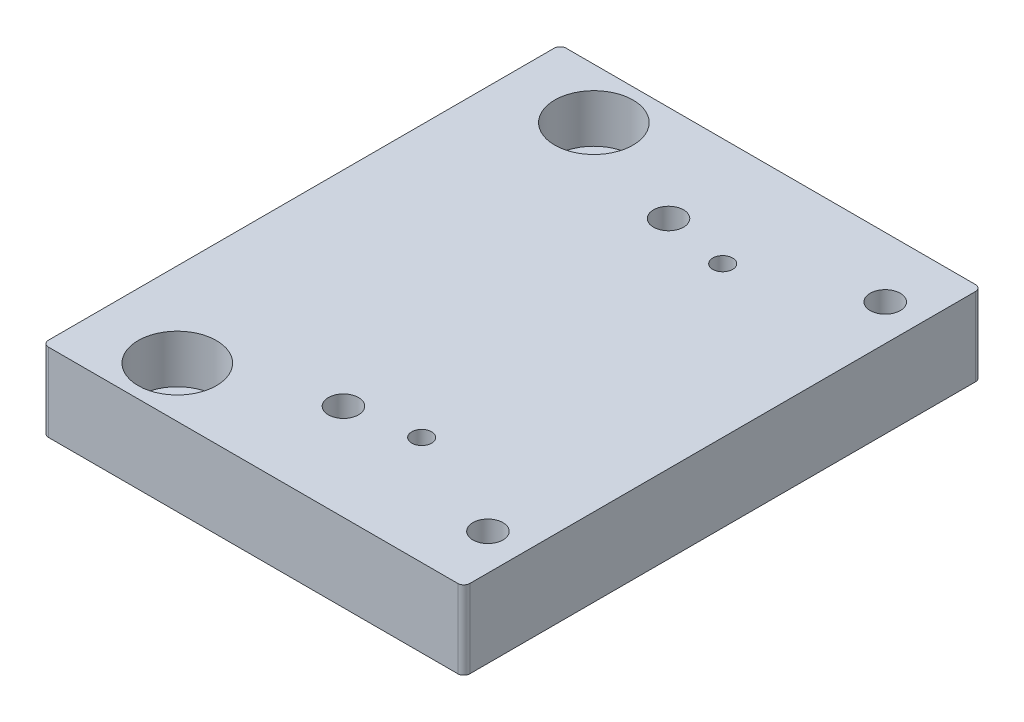
ISO-10303-21;
HEADER;
FILE_DESCRIPTION(('STEP AP214'),'2;1');
FILE_NAME('part.step','',(''),(''),'','','');
FILE_SCHEMA(('AUTOMOTIVE_DESIGN { 1 0 10303 214 1 1 1 1 }'));
ENDSEC;
DATA;
#1=APPLICATION_CONTEXT('core data for automotive mechanical design processes');
#2=APPLICATION_PROTOCOL_DEFINITION('international standard','automotive_design',2000,#1);
#3=PRODUCT_CONTEXT('',#1,'mechanical');
#4=PRODUCT('Part','Part','',(#3));
#5=PRODUCT_RELATED_PRODUCT_CATEGORY('part','',(#4));
#6=PRODUCT_DEFINITION_FORMATION('','',#4);
#7=PRODUCT_DEFINITION_CONTEXT('part definition',#1,'design');
#8=PRODUCT_DEFINITION('design','',#6,#7);
#9=PRODUCT_DEFINITION_SHAPE('','',#8);
#10=(LENGTH_UNIT() NAMED_UNIT(*) SI_UNIT(.MILLI.,.METRE.));
#11=(NAMED_UNIT(*) PLANE_ANGLE_UNIT() SI_UNIT($,.RADIAN.));
#12=(NAMED_UNIT(*) SI_UNIT($,.STERADIAN.) SOLID_ANGLE_UNIT());
#13=UNCERTAINTY_MEASURE_WITH_UNIT(LENGTH_MEASURE(1.E-05),#10,'distance_accuracy_value','');
#14=(GEOMETRIC_REPRESENTATION_CONTEXT(3) GLOBAL_UNCERTAINTY_ASSIGNED_CONTEXT((#13)) GLOBAL_UNIT_ASSIGNED_CONTEXT((#10,
#11,#12)) REPRESENTATION_CONTEXT('',''));
#15=CARTESIAN_POINT('',(0.,0.,0.));
#16=DIRECTION('',(0.,0.,1.));
#17=DIRECTION('',(1.,0.,0.));
#18=AXIS2_PLACEMENT_3D('',#15,#16,#17);
#19=CARTESIAN_POINT('',(14.,-8.,77.6));
#20=DIRECTION('',(0.,1.,0.));
#21=DIRECTION('',(0.,0.,1.));
#22=AXIS2_PLACEMENT_3D('',#19,#20,#21);
#23=CYLINDRICAL_SURFACE('',#22,2.99999999999999);
#24=CARTESIAN_POINT('',(14.,-8.,77.6));
#25=DIRECTION('',(0.,1.,0.));
#26=DIRECTION('',(0.,0.,-1.));
#27=AXIS2_PLACEMENT_3D('',#24,#25,#26);
#28=CIRCLE('',#27,2.99999999999999);
#29=CARTESIAN_POINT('',(14.,-8.,74.6));
#30=VERTEX_POINT('',#29);
#31=EDGE_CURVE('E129',#30,#30,#28,.T.);
#32=ORIENTED_EDGE('',*,*,#31,.F.);
#33=EDGE_LOOP('',(#32));
#34=FACE_BOUND('',#33,.T.);
#35=CARTESIAN_POINT('',(14.,-3.,77.6));
#36=DIRECTION('',(0.,1.,0.));
#37=DIRECTION('',(0.,0.,1.));
#38=AXIS2_PLACEMENT_3D('',#35,#36,#37);
#39=CIRCLE('',#38,2.99999999999999);
#40=CARTESIAN_POINT('',(14.,-3.,80.6));
#41=VERTEX_POINT('',#40);
#42=EDGE_CURVE('E37',#41,#41,#39,.F.);
#43=ORIENTED_EDGE('',*,*,#42,.F.);
#44=EDGE_LOOP('',(#43));
#45=FACE_BOUND('',#44,.T.);
#46=ADVANCED_FACE('F33',(#34,#45),#23,.F.);
#47=CARTESIAN_POINT('',(14.,-8.,8.4));
#48=DIRECTION('',(0.,1.,0.));
#49=DIRECTION('',(0.,0.,1.));
#50=AXIS2_PLACEMENT_3D('',#47,#48,#49);
#51=CYLINDRICAL_SURFACE('',#50,3.);
#52=CARTESIAN_POINT('',(14.,-8.,8.4));
#53=DIRECTION('',(0.,1.,0.));
#54=DIRECTION('',(0.,0.,1.));
#55=AXIS2_PLACEMENT_3D('',#52,#53,#54);
#56=CIRCLE('',#55,3.);
#57=CARTESIAN_POINT('',(14.,-8.,11.4));
#58=VERTEX_POINT('',#57);
#59=EDGE_CURVE('E126',#58,#58,#56,.T.);
#60=ORIENTED_EDGE('',*,*,#59,.F.);
#61=EDGE_LOOP('',(#60));
#62=FACE_BOUND('',#61,.T.);
#63=CARTESIAN_POINT('',(14.,-3.,8.4));
#64=DIRECTION('',(0.,1.,0.));
#65=DIRECTION('',(0.,0.,1.));
#66=AXIS2_PLACEMENT_3D('',#63,#64,#65);
#67=CIRCLE('',#66,3.);
#68=CARTESIAN_POINT('',(14.,-3.,11.4));
#69=VERTEX_POINT('',#68);
#70=EDGE_CURVE('E169',#69,#69,#67,.F.);
#71=ORIENTED_EDGE('',*,*,#70,.F.);
#72=EDGE_LOOP('',(#71));
#73=FACE_BOUND('',#72,.T.);
#74=ADVANCED_FACE('F227',(#62,#73),#51,.F.);
#75=CARTESIAN_POINT('',(0.,5.,0.));
#76=DIRECTION('',(1.,0.,0.));
#77=DIRECTION('',(0.,0.,-1.));
#78=AXIS2_PLACEMENT_3D('',#75,#76,#77);
#79=PLANE('',#78);
#80=DIRECTION('',(0.,0.,1.));
#81=VECTOR('',#80,1.);
#82=CARTESIAN_POINT('',(0.,5.,0.));
#83=LINE('',#82,#81);
#84=CARTESIAN_POINT('',(0.,5.,1.));
#85=VERTEX_POINT('',#84);
#86=CARTESIAN_POINT('',(0.,5.,85.));
#87=VERTEX_POINT('',#86);
#88=EDGE_CURVE('E148',#85,#87,#83,.T.);
#89=ORIENTED_EDGE('',*,*,#88,.F.);
#90=DIRECTION('',(0.,-1.,0.));
#91=VECTOR('',#90,1.);
#92=CARTESIAN_POINT('',(0.,5.,1.));
#93=LINE('',#92,#91);
#94=CARTESIAN_POINT('',(0.,-8.,1.));
#95=VERTEX_POINT('',#94);
#96=EDGE_CURVE('E11',#85,#95,#93,.T.);
#97=ORIENTED_EDGE('',*,*,#96,.T.);
#98=DIRECTION('',(0.,0.,-1.));
#99=VECTOR('',#98,1.);
#100=CARTESIAN_POINT('',(0.,-8.,85.));
#101=LINE('',#100,#99);
#102=CARTESIAN_POINT('',(0.,-8.,85.));
#103=VERTEX_POINT('',#102);
#104=EDGE_CURVE('E140',#103,#95,#101,.T.);
#105=ORIENTED_EDGE('',*,*,#104,.F.);
#106=DIRECTION('',(0.,-1.,0.));
#107=VECTOR('',#106,1.);
#108=CARTESIAN_POINT('',(0.,5.,85.));
#109=LINE('',#108,#107);
#110=EDGE_CURVE('E42',#103,#87,#109,.F.);
#111=ORIENTED_EDGE('',*,*,#110,.T.);
#112=EDGE_LOOP('',(#89,#97,#105,#111));
#113=FACE_BOUND('',#112,.T.);
#114=ADVANCED_FACE('F271',(#113),#79,.F.);
#115=CARTESIAN_POINT('',(0.,5.,86.));
#116=DIRECTION('',(0.,0.,-1.));
#117=DIRECTION('',(-1.,0.,0.));
#118=AXIS2_PLACEMENT_3D('',#115,#116,#117);
#119=PLANE('',#118);
#120=DIRECTION('',(0.,-1.,0.));
#121=VECTOR('',#120,1.);
#122=CARTESIAN_POINT('',(1.00000000000001,5.,86.));
#123=LINE('',#122,#121);
#124=CARTESIAN_POINT('',(1.00000000000001,5.,86.));
#125=VERTEX_POINT('',#124);
#126=CARTESIAN_POINT('',(1.00000000000001,-8.,86.));
#127=VERTEX_POINT('',#126);
#128=EDGE_CURVE('E155',#125,#127,#123,.T.);
#129=ORIENTED_EDGE('',*,*,#128,.T.);
#130=DIRECTION('',(-1.,0.,0.));
#131=VECTOR('',#130,1.);
#132=CARTESIAN_POINT('',(69.,-8.,86.));
#133=LINE('',#132,#131);
#134=CARTESIAN_POINT('',(69.,-8.,86.));
#135=VERTEX_POINT('',#134);
#136=EDGE_CURVE('E134',#135,#127,#133,.T.);
#137=ORIENTED_EDGE('',*,*,#136,.F.);
#138=DIRECTION('',(0.,-1.,0.));
#139=VECTOR('',#138,1.);
#140=CARTESIAN_POINT('',(69.,5.,86.));
#141=LINE('',#140,#139);
#142=CARTESIAN_POINT('',(69.,5.,86.));
#143=VERTEX_POINT('',#142);
#144=EDGE_CURVE('E157',#135,#143,#141,.F.);
#145=ORIENTED_EDGE('',*,*,#144,.T.);
#146=DIRECTION('',(1.,0.,0.));
#147=VECTOR('',#146,1.);
#148=CARTESIAN_POINT('',(0.,5.,86.));
#149=LINE('',#148,#147);
#150=EDGE_CURVE('E150',#125,#143,#149,.T.);
#151=ORIENTED_EDGE('',*,*,#150,.F.);
#152=EDGE_LOOP('',(#129,#137,#145,#151));
#153=FACE_BOUND('',#152,.T.);
#154=ADVANCED_FACE('F268',(#153),#119,.F.);
#155=CARTESIAN_POINT('',(70.,5.,0.));
#156=DIRECTION('',(-1.,0.,0.));
#157=DIRECTION('',(0.,0.,1.));
#158=AXIS2_PLACEMENT_3D('',#155,#156,#157);
#159=PLANE('',#158);
#160=DIRECTION('',(0.,0.,1.));
#161=VECTOR('',#160,1.);
#162=CARTESIAN_POINT('',(70.,5.,0.));
#163=LINE('',#162,#161);
#164=CARTESIAN_POINT('',(70.,5.,1.));
#165=VERTEX_POINT('',#164);
#166=CARTESIAN_POINT('',(70.,5.,85.));
#167=VERTEX_POINT('',#166);
#168=EDGE_CURVE('E146',#165,#167,#163,.T.);
#169=ORIENTED_EDGE('',*,*,#168,.T.);
#170=DIRECTION('',(0.,-1.,0.));
#171=VECTOR('',#170,1.);
#172=CARTESIAN_POINT('',(70.,5.,85.));
#173=LINE('',#172,#171);
#174=CARTESIAN_POINT('',(70.,-8.,85.));
#175=VERTEX_POINT('',#174);
#176=EDGE_CURVE('E109',#167,#175,#173,.T.);
#177=ORIENTED_EDGE('',*,*,#176,.T.);
#178=DIRECTION('',(0.,0.,1.));
#179=VECTOR('',#178,1.);
#180=CARTESIAN_POINT('',(70.,-8.,1.));
#181=LINE('',#180,#179);
#182=CARTESIAN_POINT('',(70.,-8.,1.));
#183=VERTEX_POINT('',#182);
#184=EDGE_CURVE('E113',#183,#175,#181,.T.);
#185=ORIENTED_EDGE('',*,*,#184,.F.);
#186=DIRECTION('',(0.,-1.,0.));
#187=VECTOR('',#186,1.);
#188=CARTESIAN_POINT('',(70.,5.,1.));
#189=LINE('',#188,#187);
#190=EDGE_CURVE('E99',#183,#165,#189,.F.);
#191=ORIENTED_EDGE('',*,*,#190,.T.);
#192=EDGE_LOOP('',(#169,#177,#185,#191));
#193=FACE_BOUND('',#192,.T.);
#194=ADVANCED_FACE('F114',(#193),#159,.F.);
#195=CARTESIAN_POINT('',(0.,5.,0.));
#196=DIRECTION('',(0.,0.,1.));
#197=DIRECTION('',(1.,0.,0.));
#198=AXIS2_PLACEMENT_3D('',#195,#196,#197);
#199=PLANE('',#198);
#200=DIRECTION('',(-1.,0.,0.));
#201=VECTOR('',#200,1.);
#202=CARTESIAN_POINT('',(0.,5.,0.));
#203=LINE('',#202,#201);
#204=CARTESIAN_POINT('',(69.,5.,0.));
#205=VERTEX_POINT('',#204);
#206=CARTESIAN_POINT('',(1.,5.,0.));
#207=VERTEX_POINT('',#206);
#208=EDGE_CURVE('E110',#205,#207,#203,.T.);
#209=ORIENTED_EDGE('',*,*,#208,.F.);
#210=DIRECTION('',(0.,-1.,0.));
#211=VECTOR('',#210,1.);
#212=CARTESIAN_POINT('',(69.,5.,0.));
#213=LINE('',#212,#211);
#214=CARTESIAN_POINT('',(69.,-8.,0.));
#215=VERTEX_POINT('',#214);
#216=EDGE_CURVE('E167',#205,#215,#213,.T.);
#217=ORIENTED_EDGE('',*,*,#216,.T.);
#218=DIRECTION('',(1.,0.,0.));
#219=VECTOR('',#218,1.);
#220=CARTESIAN_POINT('',(1.,-8.,0.));
#221=LINE('',#220,#219);
#222=CARTESIAN_POINT('',(1.,-8.,0.));
#223=VERTEX_POINT('',#222);
#224=EDGE_CURVE('E125',#223,#215,#221,.T.);
#225=ORIENTED_EDGE('',*,*,#224,.F.);
#226=DIRECTION('',(0.,-1.,0.));
#227=VECTOR('',#226,1.);
#228=CARTESIAN_POINT('',(1.,5.,0.));
#229=LINE('',#228,#227);
#230=EDGE_CURVE('E165',#223,#207,#229,.F.);
#231=ORIENTED_EDGE('',*,*,#230,.T.);
#232=EDGE_LOOP('',(#209,#217,#225,#231));
#233=FACE_BOUND('',#232,.T.);
#234=ADVANCED_FACE('F245',(#233),#199,.F.);
#235=CARTESIAN_POINT('',(0.,5.,0.));
#236=DIRECTION('',(0.,1.,0.));
#237=DIRECTION('',(0.,0.,1.));
#238=AXIS2_PLACEMENT_3D('',#235,#236,#237);
#239=PLANE('',#238);
#240=CARTESIAN_POINT('',(14.,5.,77.6));
#241=DIRECTION('',(0.,1.,0.));
#242=DIRECTION('',(0.,0.,1.));
#243=AXIS2_PLACEMENT_3D('',#240,#241,#242);
#244=CIRCLE('',#243,6.5);
#245=CARTESIAN_POINT('',(14.,5.,84.1));
#246=VERTEX_POINT('',#245);
#247=EDGE_CURVE('E186',#246,#246,#244,.T.);
#248=ORIENTED_EDGE('',*,*,#247,.F.);
#249=EDGE_LOOP('',(#248));
#250=FACE_BOUND('',#249,.T.);
#251=CARTESIAN_POINT('',(14.,5.,8.4));
#252=DIRECTION('',(0.,1.,0.));
#253=DIRECTION('',(0.,0.,1.));
#254=AXIS2_PLACEMENT_3D('',#251,#252,#253);
#255=CIRCLE('',#254,6.5);
#256=CARTESIAN_POINT('',(14.,5.,14.9));
#257=VERTEX_POINT('',#256);
#258=EDGE_CURVE('E179',#257,#257,#255,.T.);
#259=ORIENTED_EDGE('',*,*,#258,.F.);
#260=EDGE_LOOP('',(#259));
#261=FACE_BOUND('',#260,.T.);
#262=CARTESIAN_POINT('',(64.,5.,76.));
#263=DIRECTION('',(0.,1.,0.));
#264=DIRECTION('',(0.,0.,-1.));
#265=AXIS2_PLACEMENT_3D('',#262,#263,#264);
#266=CIRCLE('',#265,2.50000000000001);
#267=CARTESIAN_POINT('',(64.,5.,73.5));
#268=VERTEX_POINT('',#267);
#269=EDGE_CURVE('E193',#268,#268,#266,.T.);
#270=ORIENTED_EDGE('',*,*,#269,.F.);
#271=EDGE_LOOP('',(#270));
#272=FACE_BOUND('',#271,.T.);
#273=CARTESIAN_POINT('',(34.,5.,70.));
#274=DIRECTION('',(0.,1.,0.));
#275=DIRECTION('',(0.,0.,1.));
#276=AXIS2_PLACEMENT_3D('',#273,#274,#275);
#277=CIRCLE('',#276,2.5);
#278=CARTESIAN_POINT('',(34.,5.,72.5));
#279=VERTEX_POINT('',#278);
#280=EDGE_CURVE('E199',#279,#279,#277,.T.);
#281=ORIENTED_EDGE('',*,*,#280,.F.);
#282=EDGE_LOOP('',(#281));
#283=FACE_BOUND('',#282,.T.);
#284=CARTESIAN_POINT('',(34.,5.,16.));
#285=DIRECTION('',(0.,1.,0.));
#286=DIRECTION('',(0.,0.,1.));
#287=AXIS2_PLACEMENT_3D('',#284,#285,#286);
#288=CIRCLE('',#287,2.5);
#289=CARTESIAN_POINT('',(34.,5.,18.5));
#290=VERTEX_POINT('',#289);
#291=EDGE_CURVE('E171',#290,#290,#288,.T.);
#292=ORIENTED_EDGE('',*,*,#291,.F.);
#293=EDGE_LOOP('',(#292));
#294=FACE_BOUND('',#293,.T.);
#295=CARTESIAN_POINT('',(64.,5.,10.));
#296=DIRECTION('',(0.,1.,0.));
#297=DIRECTION('',(0.,0.,1.));
#298=AXIS2_PLACEMENT_3D('',#295,#296,#297);
#299=CIRCLE('',#298,2.50000000000001);
#300=CARTESIAN_POINT('',(64.,5.,12.5));
#301=VERTEX_POINT('',#300);
#302=EDGE_CURVE('E192',#301,#301,#299,.T.);
#303=ORIENTED_EDGE('',*,*,#302,.F.);
#304=EDGE_LOOP('',(#303));
#305=FACE_BOUND('',#304,.T.);
#306=CARTESIAN_POINT('',(45.,5.,18.));
#307=DIRECTION('',(0.,-1.,0.));
#308=DIRECTION('',(0.,0.,1.));
#309=AXIS2_PLACEMENT_3D('',#306,#307,#308);
#310=CIRCLE('',#309,1.65);
#311=CARTESIAN_POINT('',(45.,5.,19.65));
#312=VERTEX_POINT('',#311);
#313=EDGE_CURVE('E212',#312,#312,#310,.T.);
#314=ORIENTED_EDGE('',*,*,#313,.T.);
#315=EDGE_LOOP('',(#314));
#316=FACE_BOUND('',#315,.T.);
#317=CARTESIAN_POINT('',(45.,5.,68.));
#318=DIRECTION('',(0.,-1.,0.));
#319=DIRECTION('',(0.,0.,-1.));
#320=AXIS2_PLACEMENT_3D('',#317,#318,#319);
#321=CIRCLE('',#320,1.65);
#322=CARTESIAN_POINT('',(45.,5.,66.35));
#323=VERTEX_POINT('',#322);
#324=EDGE_CURVE('E218',#323,#323,#321,.T.);
#325=ORIENTED_EDGE('',*,*,#324,.T.);
#326=EDGE_LOOP('',(#325));
#327=FACE_BOUND('',#326,.T.);
#328=ORIENTED_EDGE('',*,*,#150,.T.);
#329=CARTESIAN_POINT('',(69.,5.,85.));
#330=DIRECTION('',(0.,1.,0.));
#331=DIRECTION('',(0.,0.,1.));
#332=AXIS2_PLACEMENT_3D('',#329,#330,#331);
#333=CIRCLE('',#332,1.);
#334=EDGE_CURVE('E163',#143,#167,#333,.T.);
#335=ORIENTED_EDGE('',*,*,#334,.T.);
#336=ORIENTED_EDGE('',*,*,#168,.F.);
#337=CARTESIAN_POINT('',(69.,5.,1.));
#338=DIRECTION('',(0.,1.,0.));
#339=DIRECTION('',(0.,0.,1.));
#340=AXIS2_PLACEMENT_3D('',#337,#338,#339);
#341=CIRCLE('',#340,1.);
#342=EDGE_CURVE('E105',#165,#205,#341,.T.);
#343=ORIENTED_EDGE('',*,*,#342,.T.);
#344=ORIENTED_EDGE('',*,*,#208,.T.);
#345=CARTESIAN_POINT('',(1.,5.,1.));
#346=DIRECTION('',(0.,1.,0.));
#347=DIRECTION('',(0.,0.,1.));
#348=AXIS2_PLACEMENT_3D('',#345,#346,#347);
#349=CIRCLE('',#348,1.);
#350=EDGE_CURVE('E56',#207,#85,#349,.T.);
#351=ORIENTED_EDGE('',*,*,#350,.T.);
#352=ORIENTED_EDGE('',*,*,#88,.T.);
#353=CARTESIAN_POINT('',(1.00000000000001,5.,85.));
#354=DIRECTION('',(0.,1.,0.));
#355=DIRECTION('',(0.,0.,1.));
#356=AXIS2_PLACEMENT_3D('',#353,#354,#355);
#357=CIRCLE('',#356,1.);
#358=EDGE_CURVE('E159',#87,#125,#357,.T.);
#359=ORIENTED_EDGE('',*,*,#358,.T.);
#360=EDGE_LOOP('',(#328,#335,#336,#343,#344,#351,#352,#359));
#361=FACE_BOUND('',#360,.T.);
#362=ADVANCED_FACE('F241',(#250,#261,#272,#283,#294,#305,#316,#327,#361),#239,.T.);
#363=CARTESIAN_POINT('',(69.,5.,85.));
#364=DIRECTION('',(0.,-1.,0.));
#365=DIRECTION('',(0.,0.,-1.));
#366=AXIS2_PLACEMENT_3D('',#363,#364,#365);
#367=CYLINDRICAL_SURFACE('',#366,1.);
#368=ORIENTED_EDGE('',*,*,#334,.F.);
#369=ORIENTED_EDGE('',*,*,#144,.F.);
#370=CARTESIAN_POINT('',(69.,-8.,85.));
#371=DIRECTION('',(0.,-1.,0.));
#372=DIRECTION('',(0.,0.,-1.));
#373=AXIS2_PLACEMENT_3D('',#370,#371,#372);
#374=CIRCLE('',#373,0.999999999999994);
#375=EDGE_CURVE('E119',#175,#135,#374,.T.);
#376=ORIENTED_EDGE('',*,*,#375,.F.);
#377=ORIENTED_EDGE('',*,*,#176,.F.);
#378=EDGE_LOOP('',(#368,#369,#376,#377));
#379=FACE_BOUND('',#378,.T.);
#380=ADVANCED_FACE('F244',(#379),#367,.T.);
#381=CARTESIAN_POINT('',(69.,5.,1.));
#382=DIRECTION('',(0.,-1.,0.));
#383=DIRECTION('',(0.,0.,-1.));
#384=AXIS2_PLACEMENT_3D('',#381,#382,#383);
#385=CYLINDRICAL_SURFACE('',#384,1.);
#386=ORIENTED_EDGE('',*,*,#342,.F.);
#387=ORIENTED_EDGE('',*,*,#190,.F.);
#388=CARTESIAN_POINT('',(69.,-8.,1.));
#389=DIRECTION('',(0.,-1.,0.));
#390=DIRECTION('',(0.,0.,-1.));
#391=AXIS2_PLACEMENT_3D('',#388,#389,#390);
#392=CIRCLE('',#391,0.999999999999998);
#393=EDGE_CURVE('E104',#215,#183,#392,.T.);
#394=ORIENTED_EDGE('',*,*,#393,.F.);
#395=ORIENTED_EDGE('',*,*,#216,.F.);
#396=EDGE_LOOP('',(#386,#387,#394,#395));
#397=FACE_BOUND('',#396,.T.);
#398=ADVANCED_FACE('F101',(#397),#385,.T.);
#399=CARTESIAN_POINT('',(1.,5.,1.));
#400=DIRECTION('',(0.,-1.,0.));
#401=DIRECTION('',(0.,0.,-1.));
#402=AXIS2_PLACEMENT_3D('',#399,#400,#401);
#403=CYLINDRICAL_SURFACE('',#402,1.);
#404=ORIENTED_EDGE('',*,*,#350,.F.);
#405=ORIENTED_EDGE('',*,*,#230,.F.);
#406=CARTESIAN_POINT('',(1.,-8.,1.));
#407=DIRECTION('',(0.,-1.,0.));
#408=DIRECTION('',(0.,0.,-1.));
#409=AXIS2_PLACEMENT_3D('',#406,#407,#408);
#410=CIRCLE('',#409,0.999999999999995);
#411=EDGE_CURVE('E143',#95,#223,#410,.T.);
#412=ORIENTED_EDGE('',*,*,#411,.F.);
#413=ORIENTED_EDGE('',*,*,#96,.F.);
#414=EDGE_LOOP('',(#404,#405,#412,#413));
#415=FACE_BOUND('',#414,.T.);
#416=ADVANCED_FACE('F274',(#415),#403,.T.);
#417=CARTESIAN_POINT('',(1.00000000000001,5.,85.));
#418=DIRECTION('',(0.,-1.,0.));
#419=DIRECTION('',(0.,0.,-1.));
#420=AXIS2_PLACEMENT_3D('',#417,#418,#419);
#421=CYLINDRICAL_SURFACE('',#420,1.);
#422=ORIENTED_EDGE('',*,*,#358,.F.);
#423=ORIENTED_EDGE('',*,*,#110,.F.);
#424=CARTESIAN_POINT('',(1.00000000000001,-8.,85.));
#425=DIRECTION('',(0.,-1.,0.));
#426=DIRECTION('',(0.,0.,-1.));
#427=AXIS2_PLACEMENT_3D('',#424,#425,#426);
#428=CIRCLE('',#427,0.999999999999994);
#429=EDGE_CURVE('E137',#127,#103,#428,.T.);
#430=ORIENTED_EDGE('',*,*,#429,.F.);
#431=ORIENTED_EDGE('',*,*,#128,.F.);
#432=EDGE_LOOP('',(#422,#423,#430,#431));
#433=FACE_BOUND('',#432,.T.);
#434=ADVANCED_FACE('F35',(#433),#421,.T.);
#435=CARTESIAN_POINT('',(69.,-8.,1.));
#436=DIRECTION('',(0.,-1.,0.));
#437=DIRECTION('',(0.,0.,-1.));
#438=AXIS2_PLACEMENT_3D('',#435,#436,#437);
#439=PLANE('',#438);
#440=CARTESIAN_POINT('',(64.,-8.,76.));
#441=DIRECTION('',(0.,1.,0.));
#442=DIRECTION('',(0.,0.,-1.));
#443=AXIS2_PLACEMENT_3D('',#440,#441,#442);
#444=CIRCLE('',#443,2.50000000000001);
#445=CARTESIAN_POINT('',(64.,-8.,73.5));
#446=VERTEX_POINT('',#445);
#447=EDGE_CURVE('E189',#446,#446,#444,.T.);
#448=ORIENTED_EDGE('',*,*,#447,.T.);
#449=EDGE_LOOP('',(#448));
#450=FACE_BOUND('',#449,.T.);
#451=CARTESIAN_POINT('',(34.,-8.,70.));
#452=DIRECTION('',(0.,1.,0.));
#453=DIRECTION('',(0.,0.,1.));
#454=AXIS2_PLACEMENT_3D('',#451,#452,#453);
#455=CIRCLE('',#454,2.5);
#456=CARTESIAN_POINT('',(34.,-8.,72.5));
#457=VERTEX_POINT('',#456);
#458=EDGE_CURVE('E196',#457,#457,#455,.T.);
#459=ORIENTED_EDGE('',*,*,#458,.T.);
#460=EDGE_LOOP('',(#459));
#461=FACE_BOUND('',#460,.T.);
#462=CARTESIAN_POINT('',(34.,-8.,16.));
#463=DIRECTION('',(0.,1.,0.));
#464=DIRECTION('',(0.,0.,1.));
#465=AXIS2_PLACEMENT_3D('',#462,#463,#464);
#466=CIRCLE('',#465,2.5);
#467=CARTESIAN_POINT('',(34.,-8.,18.5));
#468=VERTEX_POINT('',#467);
#469=EDGE_CURVE('E176',#468,#468,#466,.T.);
#470=ORIENTED_EDGE('',*,*,#469,.T.);
#471=EDGE_LOOP('',(#470));
#472=FACE_BOUND('',#471,.T.);
#473=CARTESIAN_POINT('',(64.,-8.,10.));
#474=DIRECTION('',(0.,1.,0.));
#475=DIRECTION('',(0.,0.,1.));
#476=AXIS2_PLACEMENT_3D('',#473,#474,#475);
#477=CIRCLE('',#476,2.50000000000001);
#478=CARTESIAN_POINT('',(64.,-8.,12.5));
#479=VERTEX_POINT('',#478);
#480=EDGE_CURVE('E204',#479,#479,#477,.T.);
#481=ORIENTED_EDGE('',*,*,#480,.T.);
#482=EDGE_LOOP('',(#481));
#483=FACE_BOUND('',#482,.T.);
#484=CARTESIAN_POINT('',(45.,-8.,18.));
#485=DIRECTION('',(0.,-1.,0.));
#486=DIRECTION('',(0.,0.,1.));
#487=AXIS2_PLACEMENT_3D('',#484,#485,#486);
#488=CIRCLE('',#487,1.65);
#489=CARTESIAN_POINT('',(45.,-8.,19.65));
#490=VERTEX_POINT('',#489);
#491=EDGE_CURVE('E207',#490,#490,#488,.T.);
#492=ORIENTED_EDGE('',*,*,#491,.F.);
#493=EDGE_LOOP('',(#492));
#494=FACE_BOUND('',#493,.T.);
#495=CARTESIAN_POINT('',(45.,-8.,68.));
#496=DIRECTION('',(0.,-1.,0.));
#497=DIRECTION('',(0.,0.,-1.));
#498=AXIS2_PLACEMENT_3D('',#495,#496,#497);
#499=CIRCLE('',#498,1.65);
#500=CARTESIAN_POINT('',(45.,-8.,66.35));
#501=VERTEX_POINT('',#500);
#502=EDGE_CURVE('E215',#501,#501,#499,.T.);
#503=ORIENTED_EDGE('',*,*,#502,.F.);
#504=EDGE_LOOP('',(#503));
#505=FACE_BOUND('',#504,.T.);
#506=ORIENTED_EDGE('',*,*,#31,.T.);
#507=EDGE_LOOP('',(#506));
#508=FACE_BOUND('',#507,.T.);
#509=ORIENTED_EDGE('',*,*,#59,.T.);
#510=EDGE_LOOP('',(#509));
#511=FACE_BOUND('',#510,.T.);
#512=ORIENTED_EDGE('',*,*,#393,.T.);
#513=ORIENTED_EDGE('',*,*,#184,.T.);
#514=ORIENTED_EDGE('',*,*,#375,.T.);
#515=ORIENTED_EDGE('',*,*,#136,.T.);
#516=ORIENTED_EDGE('',*,*,#429,.T.);
#517=ORIENTED_EDGE('',*,*,#104,.T.);
#518=ORIENTED_EDGE('',*,*,#411,.T.);
#519=ORIENTED_EDGE('',*,*,#224,.T.);
#520=EDGE_LOOP('',(#512,#513,#514,#515,#516,#517,#518,#519));
#521=FACE_BOUND('',#520,.T.);
#522=ADVANCED_FACE('F122',(#450,#461,#472,#483,#494,#505,#508,#511,#521),#439,.T.);
#523=CARTESIAN_POINT('',(45.,5.,68.));
#524=DIRECTION('',(0.,-1.,0.));
#525=DIRECTION('',(0.,0.,-1.));
#526=AXIS2_PLACEMENT_3D('',#523,#524,#525);
#527=CYLINDRICAL_SURFACE('',#526,1.65);
#528=ORIENTED_EDGE('',*,*,#324,.F.);
#529=EDGE_LOOP('',(#528));
#530=FACE_BOUND('',#529,.T.);
#531=ORIENTED_EDGE('',*,*,#502,.T.);
#532=EDGE_LOOP('',(#531));
#533=FACE_BOUND('',#532,.T.);
#534=ADVANCED_FACE('F301',(#530,#533),#527,.F.);
#535=CARTESIAN_POINT('',(45.,5.,18.));
#536=DIRECTION('',(0.,-1.,0.));
#537=DIRECTION('',(0.,0.,-1.));
#538=AXIS2_PLACEMENT_3D('',#535,#536,#537);
#539=CYLINDRICAL_SURFACE('',#538,1.65);
#540=ORIENTED_EDGE('',*,*,#313,.F.);
#541=EDGE_LOOP('',(#540));
#542=FACE_BOUND('',#541,.T.);
#543=ORIENTED_EDGE('',*,*,#491,.T.);
#544=EDGE_LOOP('',(#543));
#545=FACE_BOUND('',#544,.T.);
#546=ADVANCED_FACE('F307',(#542,#545),#539,.F.);
#547=CARTESIAN_POINT('',(64.,-8.,10.));
#548=DIRECTION('',(0.,1.,0.));
#549=DIRECTION('',(0.,0.,1.));
#550=AXIS2_PLACEMENT_3D('',#547,#548,#549);
#551=CYLINDRICAL_SURFACE('',#550,2.50000000000001);
#552=ORIENTED_EDGE('',*,*,#480,.F.);
#553=EDGE_LOOP('',(#552));
#554=FACE_BOUND('',#553,.T.);
#555=ORIENTED_EDGE('',*,*,#302,.T.);
#556=EDGE_LOOP('',(#555));
#557=FACE_BOUND('',#556,.T.);
#558=ADVANCED_FACE('F317',(#554,#557),#551,.F.);
#559=CARTESIAN_POINT('',(34.,-8.,16.));
#560=DIRECTION('',(0.,1.,0.));
#561=DIRECTION('',(0.,0.,1.));
#562=AXIS2_PLACEMENT_3D('',#559,#560,#561);
#563=CYLINDRICAL_SURFACE('',#562,2.5);
#564=ORIENTED_EDGE('',*,*,#469,.F.);
#565=EDGE_LOOP('',(#564));
#566=FACE_BOUND('',#565,.T.);
#567=ORIENTED_EDGE('',*,*,#291,.T.);
#568=EDGE_LOOP('',(#567));
#569=FACE_BOUND('',#568,.T.);
#570=ADVANCED_FACE('F321',(#566,#569),#563,.F.);
#571=CARTESIAN_POINT('',(34.,-8.,70.));
#572=DIRECTION('',(0.,1.,0.));
#573=DIRECTION('',(0.,0.,1.));
#574=AXIS2_PLACEMENT_3D('',#571,#572,#573);
#575=CYLINDRICAL_SURFACE('',#574,2.5);
#576=ORIENTED_EDGE('',*,*,#458,.F.);
#577=EDGE_LOOP('',(#576));
#578=FACE_BOUND('',#577,.T.);
#579=ORIENTED_EDGE('',*,*,#280,.T.);
#580=EDGE_LOOP('',(#579));
#581=FACE_BOUND('',#580,.T.);
#582=ADVANCED_FACE('F325',(#578,#581),#575,.F.);
#583=CARTESIAN_POINT('',(64.,-8.,76.));
#584=DIRECTION('',(0.,1.,0.));
#585=DIRECTION('',(0.,0.,1.));
#586=AXIS2_PLACEMENT_3D('',#583,#584,#585);
#587=CYLINDRICAL_SURFACE('',#586,2.50000000000001);
#588=ORIENTED_EDGE('',*,*,#447,.F.);
#589=EDGE_LOOP('',(#588));
#590=FACE_BOUND('',#589,.T.);
#591=ORIENTED_EDGE('',*,*,#269,.T.);
#592=EDGE_LOOP('',(#591));
#593=FACE_BOUND('',#592,.T.);
#594=ADVANCED_FACE('F329',(#590,#593),#587,.F.);
#595=CARTESIAN_POINT('',(14.,-3.,8.4));
#596=DIRECTION('',(0.,1.,0.));
#597=DIRECTION('',(0.,0.,1.));
#598=AXIS2_PLACEMENT_3D('',#595,#596,#597);
#599=PLANE('',#598);
#600=CARTESIAN_POINT('',(14.,-3.,8.4));
#601=DIRECTION('',(0.,1.,0.));
#602=DIRECTION('',(0.,0.,1.));
#603=AXIS2_PLACEMENT_3D('',#600,#601,#602);
#604=CIRCLE('',#603,6.5);
#605=CARTESIAN_POINT('',(14.,-3.,14.9));
#606=VERTEX_POINT('',#605);
#607=EDGE_CURVE('E172',#606,#606,#604,.T.);
#608=ORIENTED_EDGE('',*,*,#607,.T.);
#609=EDGE_LOOP('',(#608));
#610=FACE_BOUND('',#609,.T.);
#611=ORIENTED_EDGE('',*,*,#70,.T.);
#612=EDGE_LOOP('',(#611));
#613=FACE_BOUND('',#612,.T.);
#614=ADVANCED_FACE('F333',(#610,#613),#599,.T.);
#615=CARTESIAN_POINT('',(14.,-3.,8.4));
#616=DIRECTION('',(0.,1.,0.));
#617=DIRECTION('',(0.,0.,1.));
#618=AXIS2_PLACEMENT_3D('',#615,#616,#617);
#619=CYLINDRICAL_SURFACE('',#618,6.5);
#620=ORIENTED_EDGE('',*,*,#607,.F.);
#621=EDGE_LOOP('',(#620));
#622=FACE_BOUND('',#621,.T.);
#623=ORIENTED_EDGE('',*,*,#258,.T.);
#624=EDGE_LOOP('',(#623));
#625=FACE_BOUND('',#624,.T.);
#626=ADVANCED_FACE('F335',(#622,#625),#619,.F.);
#627=CARTESIAN_POINT('',(14.,-3.,77.6));
#628=DIRECTION('',(0.,1.,0.));
#629=DIRECTION('',(0.,0.,1.));
#630=AXIS2_PLACEMENT_3D('',#627,#628,#629);
#631=PLANE('',#630);
#632=CARTESIAN_POINT('',(14.,-3.,77.6));
#633=DIRECTION('',(0.,1.,0.));
#634=DIRECTION('',(0.,0.,1.));
#635=AXIS2_PLACEMENT_3D('',#632,#633,#634);
#636=CIRCLE('',#635,6.5);
#637=CARTESIAN_POINT('',(14.,-3.,84.1));
#638=VERTEX_POINT('',#637);
#639=EDGE_CURVE('E232',#638,#638,#636,.T.);
#640=ORIENTED_EDGE('',*,*,#639,.T.);
#641=EDGE_LOOP('',(#640));
#642=FACE_BOUND('',#641,.T.);
#643=ORIENTED_EDGE('',*,*,#42,.T.);
#644=EDGE_LOOP('',(#643));
#645=FACE_BOUND('',#644,.T.);
#646=ADVANCED_FACE('F338',(#642,#645),#631,.T.);
#647=CARTESIAN_POINT('',(14.,-3.,77.6));
#648=DIRECTION('',(0.,1.,0.));
#649=DIRECTION('',(0.,0.,1.));
#650=AXIS2_PLACEMENT_3D('',#647,#648,#649);
#651=CYLINDRICAL_SURFACE('',#650,6.5);
#652=ORIENTED_EDGE('',*,*,#639,.F.);
#653=EDGE_LOOP('',(#652));
#654=FACE_BOUND('',#653,.T.);
#655=ORIENTED_EDGE('',*,*,#247,.T.);
#656=EDGE_LOOP('',(#655));
#657=FACE_BOUND('',#656,.T.);
#658=ADVANCED_FACE('F239',(#654,#657),#651,.F.);
#659=CLOSED_SHELL('',(#46,#74,#114,#154,#194,#234,#362,#380,#398,#416,#434,#522,#534,#546,#558,
#570,#582,#594,#614,#626,#646,#658));
#660=MANIFOLD_SOLID_BREP('B2',#659);
#661=ADVANCED_BREP_SHAPE_REPRESENTATION('',(#18,#660),#14);
#662=SHAPE_DEFINITION_REPRESENTATION(#9,#661);
ENDSEC;
END-ISO-10303-21;
